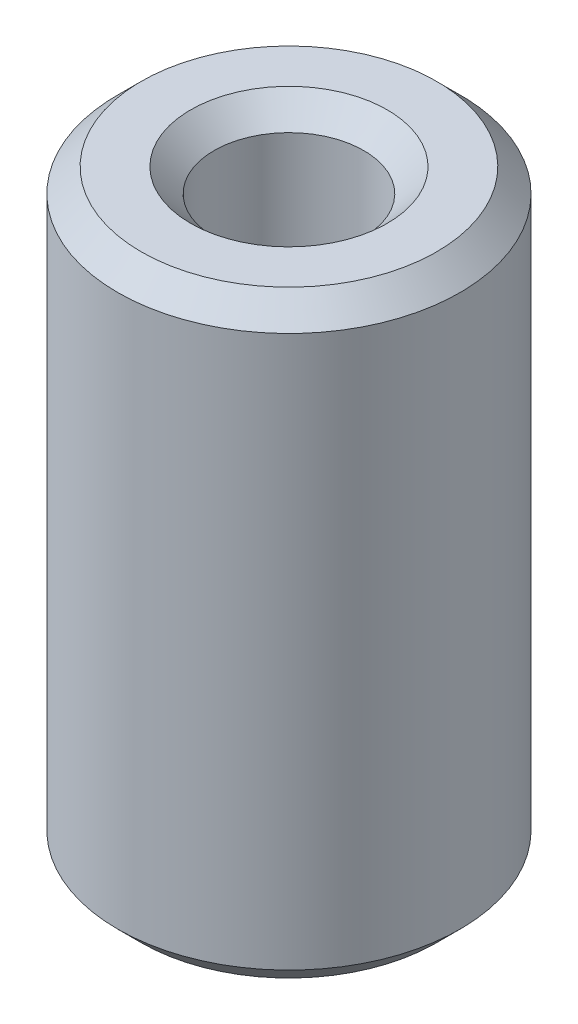
ISO-10303-21;
HEADER;
FILE_DESCRIPTION(('STEP AP214'),'2;1');
FILE_NAME('part.step','',(''),(''),'','','');
FILE_SCHEMA(('AUTOMOTIVE_DESIGN { 1 0 10303 214 1 1 1 1 }'));
ENDSEC;
DATA;
#1=APPLICATION_CONTEXT('core data for automotive mechanical design processes');
#2=APPLICATION_PROTOCOL_DEFINITION('international standard','automotive_design',2000,#1);
#3=PRODUCT_CONTEXT('',#1,'mechanical');
#4=PRODUCT('Part','Part','',(#3));
#5=PRODUCT_RELATED_PRODUCT_CATEGORY('part','',(#4));
#6=PRODUCT_DEFINITION_FORMATION('','',#4);
#7=PRODUCT_DEFINITION_CONTEXT('part definition',#1,'design');
#8=PRODUCT_DEFINITION('design','',#6,#7);
#9=PRODUCT_DEFINITION_SHAPE('','',#8);
#10=(LENGTH_UNIT() NAMED_UNIT(*) SI_UNIT(.MILLI.,.METRE.));
#11=(NAMED_UNIT(*) PLANE_ANGLE_UNIT() SI_UNIT($,.RADIAN.));
#12=(NAMED_UNIT(*) SI_UNIT($,.STERADIAN.) SOLID_ANGLE_UNIT());
#13=UNCERTAINTY_MEASURE_WITH_UNIT(LENGTH_MEASURE(1.E-05),#10,'distance_accuracy_value','');
#14=(GEOMETRIC_REPRESENTATION_CONTEXT(3) GLOBAL_UNCERTAINTY_ASSIGNED_CONTEXT((#13)) GLOBAL_UNIT_ASSIGNED_CONTEXT((#10,
#11,#12)) REPRESENTATION_CONTEXT('',''));
#15=CARTESIAN_POINT('',(0.,0.,0.));
#16=DIRECTION('',(0.,0.,1.));
#17=DIRECTION('',(1.,0.,0.));
#18=AXIS2_PLACEMENT_3D('',#15,#16,#17);
#19=CARTESIAN_POINT('',(0.,96.1115972993993,0.));
#20=DIRECTION('',(0.,-1.,0.));
#21=DIRECTION('',(0.,0.,-1.));
#22=AXIS2_PLACEMENT_3D('',#19,#20,#21);
#23=CYLINDRICAL_SURFACE('',#22,27.5);
#24=CARTESIAN_POINT('',(0.,3.77453735201917,0.));
#25=DIRECTION('',(0.,1.,0.));
#26=DIRECTION('',(0.,0.,1.));
#27=AXIS2_PLACEMENT_3D('',#24,#25,#26);
#28=CIRCLE('',#27,27.5);
#29=CARTESIAN_POINT('',(0.,3.77453735201917,27.5));
#30=VERTEX_POINT('',#29);
#31=EDGE_CURVE('E10',#30,#30,#28,.T.);
#32=ORIENTED_EDGE('',*,*,#31,.T.);
#33=EDGE_LOOP('',(#32));
#34=FACE_BOUND('',#33,.T.);
#35=CARTESIAN_POINT('',(0.,92.3370599473801,0.));
#36=DIRECTION('',(0.,1.,0.));
#37=DIRECTION('',(0.,0.,1.));
#38=AXIS2_PLACEMENT_3D('',#35,#36,#37);
#39=CIRCLE('',#38,27.5);
#40=CARTESIAN_POINT('',(0.,92.3370599473801,27.5));
#41=VERTEX_POINT('',#40);
#42=EDGE_CURVE('E50',#41,#41,#39,.F.);
#43=ORIENTED_EDGE('',*,*,#42,.T.);
#44=EDGE_LOOP('',(#43));
#45=FACE_BOUND('',#44,.T.);
#46=ADVANCED_FACE('F39',(#34,#45),#23,.T.);
#47=CARTESIAN_POINT('',(0.,96.1115972993993,0.));
#48=DIRECTION('',(0.,1.,0.));
#49=DIRECTION('',(0.,0.,1.));
#50=AXIS2_PLACEMENT_3D('',#47,#48,#49);
#51=PLANE('',#50);
#52=CARTESIAN_POINT('',(0.,96.1115972993993,0.));
#53=DIRECTION('',(0.,1.,0.));
#54=DIRECTION('',(0.,0.,1.));
#55=AXIS2_PLACEMENT_3D('',#52,#53,#54);
#56=CIRCLE('',#55,15.7985229799723);
#57=CARTESIAN_POINT('',(0.,96.1115972993993,15.7985229799723));
#58=VERTEX_POINT('',#57);
#59=EDGE_CURVE('E58',#58,#58,#56,.F.);
#60=ORIENTED_EDGE('',*,*,#59,.T.);
#61=EDGE_LOOP('',(#60));
#62=FACE_BOUND('',#61,.T.);
#63=CARTESIAN_POINT('',(0.,96.1115972993993,0.));
#64=DIRECTION('',(0.,1.,0.));
#65=DIRECTION('',(0.,0.,1.));
#66=AXIS2_PLACEMENT_3D('',#63,#64,#65);
#67=CIRCLE('',#66,23.7254626479808);
#68=CARTESIAN_POINT('',(0.,96.1115972993993,23.7254626479808));
#69=VERTEX_POINT('',#68);
#70=EDGE_CURVE('E61',#69,#69,#67,.T.);
#71=ORIENTED_EDGE('',*,*,#70,.T.);
#72=EDGE_LOOP('',(#71));
#73=FACE_BOUND('',#72,.T.);
#74=ADVANCED_FACE('F88',(#62,#73),#51,.T.);
#75=CARTESIAN_POINT('',(0.,0.,0.));
#76=DIRECTION('',(0.,1.,0.));
#77=DIRECTION('',(0.,0.,1.));
#78=AXIS2_PLACEMENT_3D('',#75,#76,#77);
#79=PLANE('',#78);
#80=CARTESIAN_POINT('',(0.,0.,0.));
#81=DIRECTION('',(0.,1.,0.));
#82=DIRECTION('',(0.,0.,1.));
#83=AXIS2_PLACEMENT_3D('',#80,#81,#82);
#84=CIRCLE('',#83,15.7985229799723);
#85=CARTESIAN_POINT('',(0.,0.,15.7985229799723));
#86=VERTEX_POINT('',#85);
#87=EDGE_CURVE('E51',#86,#86,#84,.T.);
#88=ORIENTED_EDGE('',*,*,#87,.T.);
#89=EDGE_LOOP('',(#88));
#90=FACE_BOUND('',#89,.T.);
#91=CARTESIAN_POINT('',(0.,0.,0.));
#92=DIRECTION('',(0.,1.,0.));
#93=DIRECTION('',(0.,0.,1.));
#94=AXIS2_PLACEMENT_3D('',#91,#92,#93);
#95=CIRCLE('',#94,23.7254626479808);
#96=CARTESIAN_POINT('',(0.,0.,23.7254626479808));
#97=VERTEX_POINT('',#96);
#98=EDGE_CURVE('E54',#97,#97,#95,.F.);
#99=ORIENTED_EDGE('',*,*,#98,.T.);
#100=EDGE_LOOP('',(#99));
#101=FACE_BOUND('',#100,.T.);
#102=ADVANCED_FACE('F83',(#90,#101),#79,.F.);
#103=CARTESIAN_POINT('',(0.,96.1115972993993,0.));
#104=DIRECTION('',(0.,-1.,0.));
#105=DIRECTION('',(0.,0.,-1.));
#106=AXIS2_PLACEMENT_3D('',#103,#104,#105);
#107=CYLINDRICAL_SURFACE('',#106,12.0239856279531);
#108=CARTESIAN_POINT('',(0.,92.3370599473802,0.));
#109=DIRECTION('',(0.,1.,0.));
#110=DIRECTION('',(0.,0.,1.));
#111=AXIS2_PLACEMENT_3D('',#108,#109,#110);
#112=CIRCLE('',#111,12.0239856279531);
#113=CARTESIAN_POINT('',(0.,92.3370599473802,12.0239856279531));
#114=VERTEX_POINT('',#113);
#115=EDGE_CURVE('E67',#114,#114,#112,.T.);
#116=ORIENTED_EDGE('',*,*,#115,.T.);
#117=EDGE_LOOP('',(#116));
#118=FACE_BOUND('',#117,.T.);
#119=CARTESIAN_POINT('',(0.,3.77453735201923,0.));
#120=DIRECTION('',(0.,1.,0.));
#121=DIRECTION('',(0.,0.,1.));
#122=AXIS2_PLACEMENT_3D('',#119,#120,#121);
#123=CIRCLE('',#122,12.0239856279531);
#124=CARTESIAN_POINT('',(0.,3.77453735201923,12.0239856279531));
#125=VERTEX_POINT('',#124);
#126=EDGE_CURVE('E69',#125,#125,#123,.F.);
#127=ORIENTED_EDGE('',*,*,#126,.T.);
#128=EDGE_LOOP('',(#127));
#129=FACE_BOUND('',#128,.T.);
#130=ADVANCED_FACE('F71',(#118,#129),#107,.F.);
#131=CARTESIAN_POINT('',(0.,92.3370599473802,0.));
#132=DIRECTION('',(0.,1.,0.));
#133=DIRECTION('',(0.,0.,1.));
#134=AXIS2_PLACEMENT_3D('',#131,#132,#133);
#135=CONICAL_SURFACE('',#134,12.0239856279531,0.785398163397452);
#136=CARTESIAN_POINT('',(0.,96.1115972993993,15.7985229799723));
#137=CARTESIAN_POINT('',(0.,96.0722792019825,15.7592048825554));
#138=CARTESIAN_POINT('',(0.,96.0329611045656,15.7198867851385));
#139=CARTESIAN_POINT('',(0.,95.9543249097319,15.6412505903048));
#140=CARTESIAN_POINT('',(0.,95.915006812315,15.6019324928879));
#141=CARTESIAN_POINT('',(0.,95.8363706174813,15.5232962980542));
#142=CARTESIAN_POINT('',(0.,95.7970525200644,15.4839782006373));
#143=CARTESIAN_POINT('',(0.,95.7184163252307,15.4053420058036));
#144=CARTESIAN_POINT('',(0.,95.6790982278138,15.3660239083867));
#145=CARTESIAN_POINT('',(0.,95.6004620329801,15.287387713553));
#146=CARTESIAN_POINT('',(0.,95.5611439355632,15.2480696161361));
#147=CARTESIAN_POINT('',(0.,95.4825077407295,15.1694334213024));
#148=CARTESIAN_POINT('',(0.,95.4431896433126,15.1301153238855));
#149=CARTESIAN_POINT('',(0.,95.3645534484789,15.0514791290518));
#150=CARTESIAN_POINT('',(0.,95.325235351062,15.0121610316349));
#151=CARTESIAN_POINT('',(0.,95.2465991562283,14.9335248368012));
#152=CARTESIAN_POINT('',(0.,95.2072810588114,14.8942067393843));
#153=CARTESIAN_POINT('',(0.,95.1286448639777,14.8155705445506));
#154=CARTESIAN_POINT('',(0.,95.0893267665608,14.7762524471337));
#155=CARTESIAN_POINT('',(0.,95.0106905717271,14.6976162523));
#156=CARTESIAN_POINT('',(0.,94.9713724743102,14.6582981548831));
#157=CARTESIAN_POINT('',(0.,94.8927362794765,14.5796619600494));
#158=CARTESIAN_POINT('',(0.,94.8534181820596,14.5403438626325));
#159=CARTESIAN_POINT('',(0.,94.7747819872259,14.4617076677988));
#160=CARTESIAN_POINT('',(0.,94.735463889809,14.4223895703819));
#161=CARTESIAN_POINT('',(0.,94.6568276949753,14.3437533755482));
#162=CARTESIAN_POINT('',(0.,94.6175095975584,14.3044352781313));
#163=CARTESIAN_POINT('',(0.,94.5388734027247,14.2257990832976));
#164=CARTESIAN_POINT('',(0.,94.4995553053078,14.1864809858807));
#165=CARTESIAN_POINT('',(0.,94.4209191104741,14.107844791047));
#166=CARTESIAN_POINT('',(0.,94.3816010130572,14.0685266936301));
#167=CARTESIAN_POINT('',(0.,94.3029648182235,13.9898904987964));
#168=CARTESIAN_POINT('',(0.,94.2636467208066,13.9505724013795));
#169=CARTESIAN_POINT('',(0.,94.1850105259729,13.8719362065458));
#170=CARTESIAN_POINT('',(0.,94.145692428556,13.8326181091289));
#171=CARTESIAN_POINT('',(0.,94.0670562337223,13.7539819142952));
#172=CARTESIAN_POINT('',(0.,94.0277381363054,13.7146638168783));
#173=CARTESIAN_POINT('',(0.,93.9491019414717,13.6360276220446));
#174=CARTESIAN_POINT('',(0.,93.9097838440548,13.5967095246277));
#175=CARTESIAN_POINT('',(0.,93.8311476492211,13.518073329794));
#176=CARTESIAN_POINT('',(0.,93.7918295518042,13.4787552323771));
#177=CARTESIAN_POINT('',(0.,93.7131933569705,13.4001190375434));
#178=CARTESIAN_POINT('',(0.,93.6738752595536,13.3608009401265));
#179=CARTESIAN_POINT('',(0.,93.5952390647199,13.2821647452928));
#180=CARTESIAN_POINT('',(0.,93.555920967303,13.2428466478759));
#181=CARTESIAN_POINT('',(0.,93.4772847724693,13.1642104530422));
#182=CARTESIAN_POINT('',(0.,93.4379666750524,13.1248923556253));
#183=CARTESIAN_POINT('',(0.,93.3593304802187,13.0462561607916));
#184=CARTESIAN_POINT('',(0.,93.3200123828018,13.0069380633747));
#185=CARTESIAN_POINT('',(0.,93.2413761879681,12.928301868541));
#186=CARTESIAN_POINT('',(0.,93.2020580905512,12.8889837711241));
#187=CARTESIAN_POINT('',(0.,93.1234218957175,12.8103475762904));
#188=CARTESIAN_POINT('',(0.,93.0841037983006,12.7710294788735));
#189=CARTESIAN_POINT('',(0.,93.0054676034669,12.6923932840398));
#190=CARTESIAN_POINT('',(0.,92.96614950605,12.6530751866229));
#191=CARTESIAN_POINT('',(0.,92.8875133112163,12.5744389917892));
#192=CARTESIAN_POINT('',(0.,92.8481952137994,12.5351208943723));
#193=CARTESIAN_POINT('',(0.,92.7695590189657,12.4564846995386));
#194=CARTESIAN_POINT('',(0.,92.7302409215488,12.4171666021217));
#195=CARTESIAN_POINT('',(0.,92.6516047267151,12.338530407288));
#196=CARTESIAN_POINT('',(0.,92.6122866292982,12.2992123098711));
#197=CARTESIAN_POINT('',(0.,92.5336504344645,12.2205761150374));
#198=CARTESIAN_POINT('',(0.,92.4943323370476,12.1812580176205));
#199=CARTESIAN_POINT('',(0.,92.4156961422139,12.1026218227868));
#200=CARTESIAN_POINT('',(0.,92.3763780447971,12.0633037253699));
#201=CARTESIAN_POINT('',(0.,92.3370599473802,12.0239856279531));
#202=B_SPLINE_CURVE_WITH_KNOTS('',3,(#136,#137,#138,#139,#140,#141,#142,#143,#144,#145,#146,
#147,#148,#149,#150,#151,#152,#153,#154,#155,#156,#157,#158,#159,#160,#161,#162,#163,#164,#165,
#166,#167,#168,#169,#170,#171,#172,#173,#174,#175,#176,#177,#178,#179,#180,#181,#182,#183,#184,
#185,#186,#187,#188,#189,#190,#191,#192,#193,#194,#195,#196,#197,#198,#199,#200,#201),
.UNSPECIFIED.,.F.,.F.,(4,2,2,2,2,2,2,2,2,2,2,2,2,2,2,2,2,2,2,2,2,2,2,2,2,2,2,2,2,2,2,2,4),(0.,
0.166812559840919,0.333625119681839,0.500437679522758,0.667250239363668,0.834062799204586,
1.00087535904551,1.16768791888643,1.33450047872734,1.50131303856825,1.66812559840917,
1.83493815825009,2.001750718091,2.16856327793192,2.33537583777284,2.50218839761376,
2.66900095745467,2.83581351729559,3.00262607713651,3.16943863697743,3.33625119681834,
3.50306375665926,3.66987631650018,3.8366888763411,4.00350143618202,4.17031399602293,
4.33712655586385,4.50393911570476,4.67075167554568,4.83756423538659,5.00437679522751,
5.17118935506843,5.33800191490934),.UNSPECIFIED.);
#203=EDGE_CURVE('BSEAM77',#58,#114,#202,.T.);
#204=ORIENTED_EDGE('',*,*,#59,.F.);
#205=ORIENTED_EDGE('',*,*,#115,.F.);
#206=ORIENTED_EDGE('',*,*,#203,.T.);
#207=ORIENTED_EDGE('',*,*,#203,.F.);
#208=EDGE_LOOP('',(#204,#206,#205,#207));
#209=FACE_BOUND('',#208,.T.);
#210=ADVANCED_FACE('F77',(#209),#135,.F.);
#211=CARTESIAN_POINT('',(0.,0.,0.));
#212=DIRECTION('',(0.,-1.,0.));
#213=DIRECTION('',(0.,0.,-1.));
#214=AXIS2_PLACEMENT_3D('',#211,#212,#213);
#215=CONICAL_SURFACE('',#214,15.7985229799723,0.785398163397443);
#216=ORIENTED_EDGE('',*,*,#126,.F.);
#217=EDGE_LOOP('',(#216));
#218=FACE_BOUND('',#217,.T.);
#219=ORIENTED_EDGE('',*,*,#87,.F.);
#220=EDGE_LOOP('',(#219));
#221=FACE_BOUND('',#220,.T.);
#222=ADVANCED_FACE('F73',(#218,#221),#215,.F.);
#223=CARTESIAN_POINT('',(0.,3.77453735201917,0.));
#224=DIRECTION('',(0.,1.,0.));
#225=DIRECTION('',(0.,0.,1.));
#226=AXIS2_PLACEMENT_3D('',#223,#224,#225);
#227=CONICAL_SURFACE('',#226,27.5,0.785398163397451);
#228=ORIENTED_EDGE('',*,*,#98,.F.);
#229=EDGE_LOOP('',(#228));
#230=FACE_BOUND('',#229,.T.);
#231=ORIENTED_EDGE('',*,*,#31,.F.);
#232=EDGE_LOOP('',(#231));
#233=FACE_BOUND('',#232,.T.);
#234=ADVANCED_FACE('F76',(#230,#233),#227,.T.);
#235=CARTESIAN_POINT('',(0.,96.1115972993993,0.));
#236=DIRECTION('',(0.,-1.,0.));
#237=DIRECTION('',(0.,0.,-1.));
#238=AXIS2_PLACEMENT_3D('',#235,#236,#237);
#239=CONICAL_SURFACE('',#238,23.7254626479808,0.785398163397441);
#240=ORIENTED_EDGE('',*,*,#42,.F.);
#241=EDGE_LOOP('',(#240));
#242=FACE_BOUND('',#241,.T.);
#243=ORIENTED_EDGE('',*,*,#70,.F.);
#244=EDGE_LOOP('',(#243));
#245=FACE_BOUND('',#244,.T.);
#246=ADVANCED_FACE('F45',(#242,#245),#239,.T.);
#247=CLOSED_SHELL('',(#46,#74,#102,#130,#210,#222,#234,#246));
#248=MANIFOLD_SOLID_BREP('B2',#247);
#249=ADVANCED_BREP_SHAPE_REPRESENTATION('',(#18,#248),#14);
#250=SHAPE_DEFINITION_REPRESENTATION(#9,#249);
ENDSEC;
END-ISO-10303-21;
